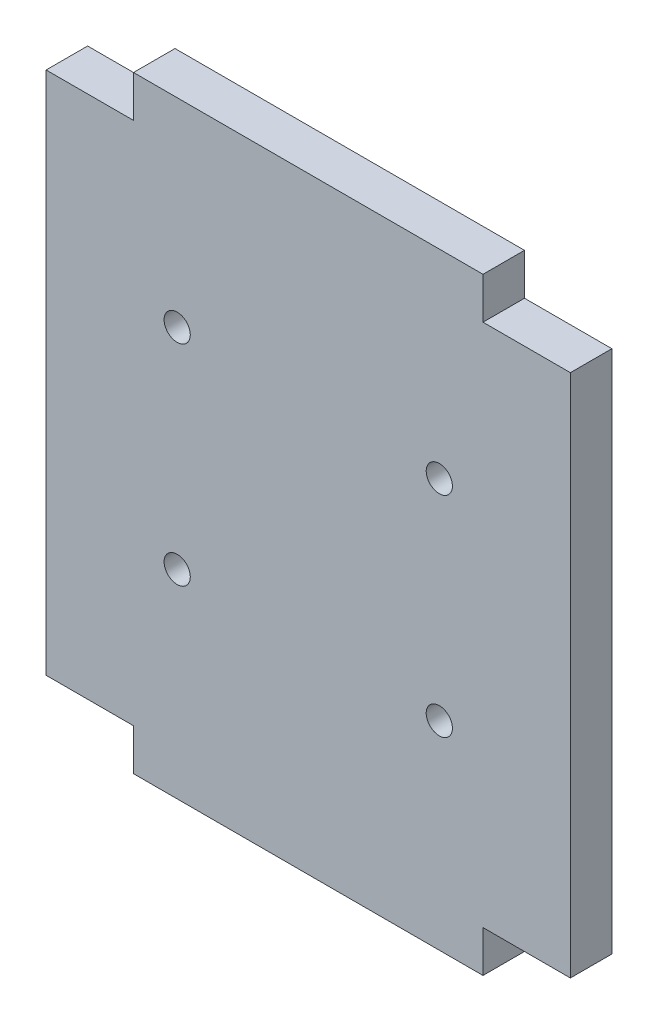
ISO-10303-21;
HEADER;
FILE_DESCRIPTION(('STEP AP214'),'2;1');
FILE_NAME('part.step','',(''),(''),'','','');
FILE_SCHEMA(('AUTOMOTIVE_DESIGN { 1 0 10303 214 1 1 1 1 }'));
ENDSEC;
DATA;
#1=APPLICATION_CONTEXT('core data for automotive mechanical design processes');
#2=APPLICATION_PROTOCOL_DEFINITION('international standard','automotive_design',2000,#1);
#3=PRODUCT_CONTEXT('',#1,'mechanical');
#4=PRODUCT('Part','Part','',(#3));
#5=PRODUCT_RELATED_PRODUCT_CATEGORY('part','',(#4));
#6=PRODUCT_DEFINITION_FORMATION('','',#4);
#7=PRODUCT_DEFINITION_CONTEXT('part definition',#1,'design');
#8=PRODUCT_DEFINITION('design','',#6,#7);
#9=PRODUCT_DEFINITION_SHAPE('','',#8);
#10=(LENGTH_UNIT() NAMED_UNIT(*) SI_UNIT(.MILLI.,.METRE.));
#11=(NAMED_UNIT(*) PLANE_ANGLE_UNIT() SI_UNIT($,.RADIAN.));
#12=(NAMED_UNIT(*) SI_UNIT($,.STERADIAN.) SOLID_ANGLE_UNIT());
#13=UNCERTAINTY_MEASURE_WITH_UNIT(LENGTH_MEASURE(1.E-05),#10,'distance_accuracy_value','');
#14=(GEOMETRIC_REPRESENTATION_CONTEXT(3) GLOBAL_UNCERTAINTY_ASSIGNED_CONTEXT((#13)) GLOBAL_UNIT_ASSIGNED_CONTEXT((#10,
#11,#12)) REPRESENTATION_CONTEXT('',''));
#15=CARTESIAN_POINT('',(0.,0.,0.));
#16=DIRECTION('',(0.,0.,1.));
#17=DIRECTION('',(1.,0.,0.));
#18=AXIS2_PLACEMENT_3D('',#15,#16,#17);
#19=CARTESIAN_POINT('',(30.,-34.75,4.75));
#20=DIRECTION('',(-1.,0.,0.));
#21=DIRECTION('',(0.,0.,1.));
#22=AXIS2_PLACEMENT_3D('',#19,#20,#21);
#23=PLANE('',#22);
#24=DIRECTION('',(0.,1.,0.));
#25=VECTOR('',#24,1.);
#26=CARTESIAN_POINT('',(30.,-34.75,0.));
#27=LINE('',#26,#25);
#28=CARTESIAN_POINT('',(30.,-30.,0.));
#29=VERTEX_POINT('',#28);
#30=CARTESIAN_POINT('',(30.,30.,0.));
#31=VERTEX_POINT('',#30);
#32=EDGE_CURVE('E157',#29,#31,#27,.T.);
#33=ORIENTED_EDGE('',*,*,#32,.T.);
#34=DIRECTION('',(0.,0.,1.));
#35=VECTOR('',#34,1.);
#36=CARTESIAN_POINT('',(30.,30.,0.));
#37=LINE('',#36,#35);
#38=CARTESIAN_POINT('',(30.,30.,4.75));
#39=VERTEX_POINT('',#38);
#40=EDGE_CURVE('E208',#31,#39,#37,.T.);
#41=ORIENTED_EDGE('',*,*,#40,.T.);
#42=DIRECTION('',(0.,1.,0.));
#43=VECTOR('',#42,1.);
#44=CARTESIAN_POINT('',(30.,-34.75,4.75));
#45=LINE('',#44,#43);
#46=CARTESIAN_POINT('',(30.,-30.,4.75));
#47=VERTEX_POINT('',#46);
#48=EDGE_CURVE('E145',#47,#39,#45,.T.);
#49=ORIENTED_EDGE('',*,*,#48,.F.);
#50=DIRECTION('',(0.,0.,1.));
#51=VECTOR('',#50,1.);
#52=CARTESIAN_POINT('',(30.,-30.,0.));
#53=LINE('',#52,#51);
#54=EDGE_CURVE('E217',#29,#47,#53,.T.);
#55=ORIENTED_EDGE('',*,*,#54,.F.);
#56=EDGE_LOOP('',(#33,#41,#49,#55));
#57=FACE_BOUND('',#56,.T.);
#58=ADVANCED_FACE('F32',(#57),#23,.F.);
#59=CARTESIAN_POINT('',(-30.,34.75,4.75));
#60=DIRECTION('',(0.,-1.,0.));
#61=DIRECTION('',(0.,0.,-1.));
#62=AXIS2_PLACEMENT_3D('',#59,#60,#61);
#63=PLANE('',#62);
#64=DIRECTION('',(-1.,0.,0.));
#65=VECTOR('',#64,1.);
#66=CARTESIAN_POINT('',(-30.,34.75,4.75));
#67=LINE('',#66,#65);
#68=CARTESIAN_POINT('',(20.,34.75,4.75));
#69=VERTEX_POINT('',#68);
#70=CARTESIAN_POINT('',(-20.,34.75,4.75));
#71=VERTEX_POINT('',#70);
#72=EDGE_CURVE('E148',#69,#71,#67,.T.);
#73=ORIENTED_EDGE('',*,*,#72,.F.);
#74=DIRECTION('',(0.,0.,1.));
#75=VECTOR('',#74,1.);
#76=CARTESIAN_POINT('',(20.,34.75,0.));
#77=LINE('',#76,#75);
#78=CARTESIAN_POINT('',(20.,34.75,0.));
#79=VERTEX_POINT('',#78);
#80=EDGE_CURVE('E204',#79,#69,#77,.T.);
#81=ORIENTED_EDGE('',*,*,#80,.F.);
#82=DIRECTION('',(-1.,0.,0.));
#83=VECTOR('',#82,1.);
#84=CARTESIAN_POINT('',(-30.,34.75,0.));
#85=LINE('',#84,#83);
#86=CARTESIAN_POINT('',(-20.,34.75,0.));
#87=VERTEX_POINT('',#86);
#88=EDGE_CURVE('E151',#79,#87,#85,.T.);
#89=ORIENTED_EDGE('',*,*,#88,.T.);
#90=DIRECTION('',(0.,0.,1.));
#91=VECTOR('',#90,1.);
#92=CARTESIAN_POINT('',(-20.,34.75,0.));
#93=LINE('',#92,#91);
#94=EDGE_CURVE('E189',#87,#71,#93,.T.);
#95=ORIENTED_EDGE('',*,*,#94,.T.);
#96=EDGE_LOOP('',(#73,#81,#89,#95));
#97=FACE_BOUND('',#96,.T.);
#98=ADVANCED_FACE('F279',(#97),#63,.F.);
#99=CARTESIAN_POINT('',(-30.,-34.75,4.75));
#100=DIRECTION('',(1.,0.,0.));
#101=DIRECTION('',(0.,0.,-1.));
#102=AXIS2_PLACEMENT_3D('',#99,#100,#101);
#103=PLANE('',#102);
#104=DIRECTION('',(0.,-1.,0.));
#105=VECTOR('',#104,1.);
#106=CARTESIAN_POINT('',(-30.,-34.75,0.));
#107=LINE('',#106,#105);
#108=CARTESIAN_POINT('',(-30.,30.,0.));
#109=VERTEX_POINT('',#108);
#110=CARTESIAN_POINT('',(-30.,-30.,0.));
#111=VERTEX_POINT('',#110);
#112=EDGE_CURVE('E146',#109,#111,#107,.T.);
#113=ORIENTED_EDGE('',*,*,#112,.T.);
#114=DIRECTION('',(0.,0.,1.));
#115=VECTOR('',#114,1.);
#116=CARTESIAN_POINT('',(-30.,-30.,0.));
#117=LINE('',#116,#115);
#118=CARTESIAN_POINT('',(-30.,-30.,4.75));
#119=VERTEX_POINT('',#118);
#120=EDGE_CURVE('E203',#111,#119,#117,.T.);
#121=ORIENTED_EDGE('',*,*,#120,.T.);
#122=DIRECTION('',(0.,-1.,0.));
#123=VECTOR('',#122,1.);
#124=CARTESIAN_POINT('',(-30.,-34.75,4.75));
#125=LINE('',#124,#123);
#126=CARTESIAN_POINT('',(-30.,30.,4.75));
#127=VERTEX_POINT('',#126);
#128=EDGE_CURVE('E40',#127,#119,#125,.T.);
#129=ORIENTED_EDGE('',*,*,#128,.F.);
#130=DIRECTION('',(0.,0.,1.));
#131=VECTOR('',#130,1.);
#132=CARTESIAN_POINT('',(-30.,30.,0.));
#133=LINE('',#132,#131);
#134=EDGE_CURVE('E190',#109,#127,#133,.T.);
#135=ORIENTED_EDGE('',*,*,#134,.F.);
#136=EDGE_LOOP('',(#113,#121,#129,#135));
#137=FACE_BOUND('',#136,.T.);
#138=ADVANCED_FACE('F288',(#137),#103,.F.);
#139=CARTESIAN_POINT('',(-30.,-34.75,4.75));
#140=DIRECTION('',(0.,1.,0.));
#141=DIRECTION('',(0.,0.,1.));
#142=AXIS2_PLACEMENT_3D('',#139,#140,#141);
#143=PLANE('',#142);
#144=DIRECTION('',(1.,0.,0.));
#145=VECTOR('',#144,1.);
#146=CARTESIAN_POINT('',(-30.,-34.75,0.));
#147=LINE('',#146,#145);
#148=CARTESIAN_POINT('',(-20.,-34.75,0.));
#149=VERTEX_POINT('',#148);
#150=CARTESIAN_POINT('',(20.,-34.75,0.));
#151=VERTEX_POINT('',#150);
#152=EDGE_CURVE('E35',#149,#151,#147,.T.);
#153=ORIENTED_EDGE('',*,*,#152,.T.);
#154=DIRECTION('',(0.,0.,1.));
#155=VECTOR('',#154,1.);
#156=CARTESIAN_POINT('',(20.,-34.75,0.));
#157=LINE('',#156,#155);
#158=CARTESIAN_POINT('',(20.,-34.75,4.75));
#159=VERTEX_POINT('',#158);
#160=EDGE_CURVE('E135',#151,#159,#157,.T.);
#161=ORIENTED_EDGE('',*,*,#160,.T.);
#162=DIRECTION('',(1.,0.,0.));
#163=VECTOR('',#162,1.);
#164=CARTESIAN_POINT('',(-30.,-34.75,4.75));
#165=LINE('',#164,#163);
#166=CARTESIAN_POINT('',(-20.,-34.75,4.75));
#167=VERTEX_POINT('',#166);
#168=EDGE_CURVE('E11',#167,#159,#165,.T.);
#169=ORIENTED_EDGE('',*,*,#168,.F.);
#170=DIRECTION('',(0.,0.,1.));
#171=VECTOR('',#170,1.);
#172=CARTESIAN_POINT('',(-20.,-34.75,0.));
#173=LINE('',#172,#171);
#174=EDGE_CURVE('E127',#149,#167,#173,.T.);
#175=ORIENTED_EDGE('',*,*,#174,.F.);
#176=EDGE_LOOP('',(#153,#161,#169,#175));
#177=FACE_BOUND('',#176,.T.);
#178=ADVANCED_FACE('F140',(#177),#143,.F.);
#179=CARTESIAN_POINT('',(0.,0.,4.75));
#180=DIRECTION('',(0.,0.,-1.));
#181=DIRECTION('',(-1.,0.,0.));
#182=AXIS2_PLACEMENT_3D('',#179,#180,#181);
#183=PLANE('',#182);
#184=CARTESIAN_POINT('',(15.,12.,4.75));
#185=DIRECTION('',(0.,0.,1.));
#186=DIRECTION('',(1.,0.,0.));
#187=AXIS2_PLACEMENT_3D('',#184,#185,#186);
#188=CIRCLE('',#187,1.5);
#189=CARTESIAN_POINT('',(16.5,12.,4.75));
#190=VERTEX_POINT('',#189);
#191=EDGE_CURVE('E233',#190,#190,#188,.T.);
#192=ORIENTED_EDGE('',*,*,#191,.F.);
#193=EDGE_LOOP('',(#192));
#194=FACE_BOUND('',#193,.T.);
#195=CARTESIAN_POINT('',(15.,-12.,4.75));
#196=DIRECTION('',(0.,0.,1.));
#197=DIRECTION('',(1.,0.,0.));
#198=AXIS2_PLACEMENT_3D('',#195,#196,#197);
#199=CIRCLE('',#198,1.5);
#200=CARTESIAN_POINT('',(16.5,-12.,4.75));
#201=VERTEX_POINT('',#200);
#202=EDGE_CURVE('E239',#201,#201,#199,.T.);
#203=ORIENTED_EDGE('',*,*,#202,.F.);
#204=EDGE_LOOP('',(#203));
#205=FACE_BOUND('',#204,.T.);
#206=CARTESIAN_POINT('',(-15.,-12.,4.75));
#207=DIRECTION('',(0.,0.,1.));
#208=DIRECTION('',(1.,0.,0.));
#209=AXIS2_PLACEMENT_3D('',#206,#207,#208);
#210=CIRCLE('',#209,1.5);
#211=CARTESIAN_POINT('',(-13.5,-12.,4.75));
#212=VERTEX_POINT('',#211);
#213=EDGE_CURVE('E245',#212,#212,#210,.T.);
#214=ORIENTED_EDGE('',*,*,#213,.F.);
#215=EDGE_LOOP('',(#214));
#216=FACE_BOUND('',#215,.T.);
#217=CARTESIAN_POINT('',(-15.,12.,4.75));
#218=DIRECTION('',(0.,0.,1.));
#219=DIRECTION('',(1.,0.,0.));
#220=AXIS2_PLACEMENT_3D('',#217,#218,#219);
#221=CIRCLE('',#220,1.5);
#222=CARTESIAN_POINT('',(-13.5,12.,4.75));
#223=VERTEX_POINT('',#222);
#224=EDGE_CURVE('E227',#223,#223,#221,.T.);
#225=ORIENTED_EDGE('',*,*,#224,.F.);
#226=EDGE_LOOP('',(#225));
#227=FACE_BOUND('',#226,.T.);
#228=ORIENTED_EDGE('',*,*,#48,.T.);
#229=DIRECTION('',(-1.,0.,0.));
#230=VECTOR('',#229,1.);
#231=CARTESIAN_POINT('',(0.,30.,4.75));
#232=LINE('',#231,#230);
#233=CARTESIAN_POINT('',(20.,30.,4.75));
#234=VERTEX_POINT('',#233);
#235=EDGE_CURVE('E161',#39,#234,#232,.T.);
#236=ORIENTED_EDGE('',*,*,#235,.T.);
#237=DIRECTION('',(0.,1.,0.));
#238=VECTOR('',#237,1.);
#239=CARTESIAN_POINT('',(20.,0.,4.75));
#240=LINE('',#239,#238);
#241=EDGE_CURVE('E169',#234,#69,#240,.T.);
#242=ORIENTED_EDGE('',*,*,#241,.T.);
#243=ORIENTED_EDGE('',*,*,#72,.T.);
#244=DIRECTION('',(0.,-1.,0.));
#245=VECTOR('',#244,1.);
#246=CARTESIAN_POINT('',(-20.,0.,4.75));
#247=LINE('',#246,#245);
#248=CARTESIAN_POINT('',(-20.,30.,4.75));
#249=VERTEX_POINT('',#248);
#250=EDGE_CURVE('E183',#71,#249,#247,.T.);
#251=ORIENTED_EDGE('',*,*,#250,.T.);
#252=DIRECTION('',(-1.,0.,0.));
#253=VECTOR('',#252,1.);
#254=CARTESIAN_POINT('',(0.,30.,4.75));
#255=LINE('',#254,#253);
#256=EDGE_CURVE('E186',#249,#127,#255,.T.);
#257=ORIENTED_EDGE('',*,*,#256,.T.);
#258=ORIENTED_EDGE('',*,*,#128,.T.);
#259=DIRECTION('',(1.,0.,0.));
#260=VECTOR('',#259,1.);
#261=CARTESIAN_POINT('',(0.,-30.,4.75));
#262=LINE('',#261,#260);
#263=CARTESIAN_POINT('',(-20.,-30.,4.75));
#264=VERTEX_POINT('',#263);
#265=EDGE_CURVE('E178',#119,#264,#262,.T.);
#266=ORIENTED_EDGE('',*,*,#265,.T.);
#267=DIRECTION('',(0.,-1.,0.));
#268=VECTOR('',#267,1.);
#269=CARTESIAN_POINT('',(-20.,0.,4.75));
#270=LINE('',#269,#268);
#271=EDGE_CURVE('E181',#264,#167,#270,.T.);
#272=ORIENTED_EDGE('',*,*,#271,.T.);
#273=ORIENTED_EDGE('',*,*,#168,.T.);
#274=DIRECTION('',(0.,1.,0.));
#275=VECTOR('',#274,1.);
#276=CARTESIAN_POINT('',(20.,0.,4.75));
#277=LINE('',#276,#275);
#278=CARTESIAN_POINT('',(20.,-30.,4.75));
#279=VERTEX_POINT('',#278);
#280=EDGE_CURVE('E172',#159,#279,#277,.T.);
#281=ORIENTED_EDGE('',*,*,#280,.T.);
#282=DIRECTION('',(1.,0.,0.));
#283=VECTOR('',#282,1.);
#284=CARTESIAN_POINT('',(0.,-30.,4.75));
#285=LINE('',#284,#283);
#286=EDGE_CURVE('E175',#279,#47,#285,.T.);
#287=ORIENTED_EDGE('',*,*,#286,.T.);
#288=EDGE_LOOP('',(#228,#236,#242,#243,#251,#257,#258,#266,#272,#273,#281,#287));
#289=FACE_BOUND('',#288,.T.);
#290=ADVANCED_FACE('F261',(#194,#205,#216,#227,#289),#183,.F.);
#291=CARTESIAN_POINT('',(0.,0.,0.));
#292=DIRECTION('',(0.,0.,-1.));
#293=DIRECTION('',(-1.,0.,0.));
#294=AXIS2_PLACEMENT_3D('',#291,#292,#293);
#295=PLANE('',#294);
#296=CARTESIAN_POINT('',(15.,12.,0.));
#297=DIRECTION('',(0.,0.,1.));
#298=DIRECTION('',(1.,0.,0.));
#299=AXIS2_PLACEMENT_3D('',#296,#297,#298);
#300=CIRCLE('',#299,1.5);
#301=CARTESIAN_POINT('',(16.5,12.,0.));
#302=VERTEX_POINT('',#301);
#303=EDGE_CURVE('E236',#302,#302,#300,.T.);
#304=ORIENTED_EDGE('',*,*,#303,.T.);
#305=EDGE_LOOP('',(#304));
#306=FACE_BOUND('',#305,.T.);
#307=CARTESIAN_POINT('',(15.,-12.,0.));
#308=DIRECTION('',(0.,0.,1.));
#309=DIRECTION('',(1.,0.,0.));
#310=AXIS2_PLACEMENT_3D('',#307,#308,#309);
#311=CIRCLE('',#310,1.5);
#312=CARTESIAN_POINT('',(16.5,-12.,0.));
#313=VERTEX_POINT('',#312);
#314=EDGE_CURVE('E242',#313,#313,#311,.T.);
#315=ORIENTED_EDGE('',*,*,#314,.T.);
#316=EDGE_LOOP('',(#315));
#317=FACE_BOUND('',#316,.T.);
#318=CARTESIAN_POINT('',(-15.,-12.,0.));
#319=DIRECTION('',(0.,0.,1.));
#320=DIRECTION('',(1.,0.,0.));
#321=AXIS2_PLACEMENT_3D('',#318,#319,#320);
#322=CIRCLE('',#321,1.5);
#323=CARTESIAN_POINT('',(-13.5,-12.,0.));
#324=VERTEX_POINT('',#323);
#325=EDGE_CURVE('E230',#324,#324,#322,.T.);
#326=ORIENTED_EDGE('',*,*,#325,.T.);
#327=EDGE_LOOP('',(#326));
#328=FACE_BOUND('',#327,.T.);
#329=CARTESIAN_POINT('',(-15.,12.,0.));
#330=DIRECTION('',(0.,0.,1.));
#331=DIRECTION('',(1.,0.,0.));
#332=AXIS2_PLACEMENT_3D('',#329,#330,#331);
#333=CIRCLE('',#332,1.5);
#334=CARTESIAN_POINT('',(-13.5,12.,0.));
#335=VERTEX_POINT('',#334);
#336=EDGE_CURVE('E216',#335,#335,#333,.T.);
#337=ORIENTED_EDGE('',*,*,#336,.T.);
#338=EDGE_LOOP('',(#337));
#339=FACE_BOUND('',#338,.T.);
#340=DIRECTION('',(1.,0.,0.));
#341=VECTOR('',#340,1.);
#342=CARTESIAN_POINT('',(30.,30.,0.));
#343=LINE('',#342,#341);
#344=CARTESIAN_POINT('',(20.,30.,0.));
#345=VERTEX_POINT('',#344);
#346=EDGE_CURVE('E48',#345,#31,#343,.T.);
#347=ORIENTED_EDGE('',*,*,#346,.T.);
#348=ORIENTED_EDGE('',*,*,#32,.F.);
#349=DIRECTION('',(-1.,0.,0.));
#350=VECTOR('',#349,1.);
#351=CARTESIAN_POINT('',(30.,-30.,0.));
#352=LINE('',#351,#350);
#353=CARTESIAN_POINT('',(20.,-30.,0.));
#354=VERTEX_POINT('',#353);
#355=EDGE_CURVE('E211',#29,#354,#352,.T.);
#356=ORIENTED_EDGE('',*,*,#355,.T.);
#357=DIRECTION('',(0.,-1.,0.));
#358=VECTOR('',#357,1.);
#359=CARTESIAN_POINT('',(20.,-34.75,0.));
#360=LINE('',#359,#358);
#361=EDGE_CURVE('E56',#354,#151,#360,.T.);
#362=ORIENTED_EDGE('',*,*,#361,.T.);
#363=ORIENTED_EDGE('',*,*,#152,.F.);
#364=DIRECTION('',(0.,1.,0.));
#365=VECTOR('',#364,1.);
#366=CARTESIAN_POINT('',(-20.,-34.75,0.));
#367=LINE('',#366,#365);
#368=CARTESIAN_POINT('',(-20.,-30.,0.));
#369=VERTEX_POINT('',#368);
#370=EDGE_CURVE('E124',#149,#369,#367,.T.);
#371=ORIENTED_EDGE('',*,*,#370,.T.);
#372=DIRECTION('',(-1.,0.,0.));
#373=VECTOR('',#372,1.);
#374=CARTESIAN_POINT('',(-30.,-30.,0.));
#375=LINE('',#374,#373);
#376=EDGE_CURVE('E134',#369,#111,#375,.T.);
#377=ORIENTED_EDGE('',*,*,#376,.T.);
#378=ORIENTED_EDGE('',*,*,#112,.F.);
#379=DIRECTION('',(1.,0.,0.));
#380=VECTOR('',#379,1.);
#381=CARTESIAN_POINT('',(-30.,30.,0.));
#382=LINE('',#381,#380);
#383=CARTESIAN_POINT('',(-20.,30.,0.));
#384=VERTEX_POINT('',#383);
#385=EDGE_CURVE('E200',#109,#384,#382,.T.);
#386=ORIENTED_EDGE('',*,*,#385,.T.);
#387=DIRECTION('',(0.,1.,0.));
#388=VECTOR('',#387,1.);
#389=CARTESIAN_POINT('',(-20.,34.75,0.));
#390=LINE('',#389,#388);
#391=EDGE_CURVE('E193',#384,#87,#390,.T.);
#392=ORIENTED_EDGE('',*,*,#391,.T.);
#393=ORIENTED_EDGE('',*,*,#88,.F.);
#394=DIRECTION('',(0.,-1.,0.));
#395=VECTOR('',#394,1.);
#396=CARTESIAN_POINT('',(20.,34.75,0.));
#397=LINE('',#396,#395);
#398=EDGE_CURVE('E213',#79,#345,#397,.T.);
#399=ORIENTED_EDGE('',*,*,#398,.T.);
#400=EDGE_LOOP('',(#347,#348,#356,#362,#363,#371,#377,#378,#386,#392,#393,#399));
#401=FACE_BOUND('',#400,.T.);
#402=ADVANCED_FACE('F143',(#306,#317,#328,#339,#401),#295,.T.);
#403=CARTESIAN_POINT('',(-20.,34.75,0.));
#404=DIRECTION('',(1.,0.,0.));
#405=DIRECTION('',(0.,0.,-1.));
#406=AXIS2_PLACEMENT_3D('',#403,#404,#405);
#407=PLANE('',#406);
#408=ORIENTED_EDGE('',*,*,#94,.F.);
#409=ORIENTED_EDGE('',*,*,#391,.F.);
#410=DIRECTION('',(0.,0.,1.));
#411=VECTOR('',#410,1.);
#412=CARTESIAN_POINT('',(-20.,30.,0.));
#413=LINE('',#412,#411);
#414=EDGE_CURVE('E192',#384,#249,#413,.T.);
#415=ORIENTED_EDGE('',*,*,#414,.T.);
#416=ORIENTED_EDGE('',*,*,#250,.F.);
#417=EDGE_LOOP('',(#408,#409,#415,#416));
#418=FACE_BOUND('',#417,.T.);
#419=ADVANCED_FACE('F282',(#418),#407,.F.);
#420=CARTESIAN_POINT('',(-30.,30.,0.));
#421=DIRECTION('',(0.,-1.,0.));
#422=DIRECTION('',(1.,0.,0.));
#423=AXIS2_PLACEMENT_3D('',#420,#421,#422);
#424=PLANE('',#423);
#425=ORIENTED_EDGE('',*,*,#414,.F.);
#426=ORIENTED_EDGE('',*,*,#385,.F.);
#427=ORIENTED_EDGE('',*,*,#134,.T.);
#428=ORIENTED_EDGE('',*,*,#256,.F.);
#429=EDGE_LOOP('',(#425,#426,#427,#428));
#430=FACE_BOUND('',#429,.T.);
#431=ADVANCED_FACE('F285',(#430),#424,.F.);
#432=CARTESIAN_POINT('',(-30.,-30.,0.));
#433=DIRECTION('',(0.,1.,0.));
#434=DIRECTION('',(-1.,0.,0.));
#435=AXIS2_PLACEMENT_3D('',#432,#433,#434);
#436=PLANE('',#435);
#437=ORIENTED_EDGE('',*,*,#120,.F.);
#438=ORIENTED_EDGE('',*,*,#376,.F.);
#439=DIRECTION('',(0.,0.,1.));
#440=VECTOR('',#439,1.);
#441=CARTESIAN_POINT('',(-20.,-30.,0.));
#442=LINE('',#441,#440);
#443=EDGE_CURVE('E130',#369,#264,#442,.T.);
#444=ORIENTED_EDGE('',*,*,#443,.T.);
#445=ORIENTED_EDGE('',*,*,#265,.F.);
#446=EDGE_LOOP('',(#437,#438,#444,#445));
#447=FACE_BOUND('',#446,.T.);
#448=ADVANCED_FACE('F287',(#447),#436,.F.);
#449=CARTESIAN_POINT('',(-20.,-34.75,0.));
#450=DIRECTION('',(1.,0.,0.));
#451=DIRECTION('',(0.,0.,-1.));
#452=AXIS2_PLACEMENT_3D('',#449,#450,#451);
#453=PLANE('',#452);
#454=ORIENTED_EDGE('',*,*,#443,.F.);
#455=ORIENTED_EDGE('',*,*,#370,.F.);
#456=ORIENTED_EDGE('',*,*,#174,.T.);
#457=ORIENTED_EDGE('',*,*,#271,.F.);
#458=EDGE_LOOP('',(#454,#455,#456,#457));
#459=FACE_BOUND('',#458,.T.);
#460=ADVANCED_FACE('F126',(#459),#453,.F.);
#461=CARTESIAN_POINT('',(20.,-34.75,0.));
#462=DIRECTION('',(-1.,0.,0.));
#463=DIRECTION('',(0.,0.,1.));
#464=AXIS2_PLACEMENT_3D('',#461,#462,#463);
#465=PLANE('',#464);
#466=ORIENTED_EDGE('',*,*,#160,.F.);
#467=ORIENTED_EDGE('',*,*,#361,.F.);
#468=DIRECTION('',(0.,0.,1.));
#469=VECTOR('',#468,1.);
#470=CARTESIAN_POINT('',(20.,-30.,0.));
#471=LINE('',#470,#469);
#472=EDGE_CURVE('E219',#354,#279,#471,.T.);
#473=ORIENTED_EDGE('',*,*,#472,.T.);
#474=ORIENTED_EDGE('',*,*,#280,.F.);
#475=EDGE_LOOP('',(#466,#467,#473,#474));
#476=FACE_BOUND('',#475,.T.);
#477=ADVANCED_FACE('F289',(#476),#465,.F.);
#478=CARTESIAN_POINT('',(30.,-30.,0.));
#479=DIRECTION('',(0.,1.,0.));
#480=DIRECTION('',(-1.,0.,0.));
#481=AXIS2_PLACEMENT_3D('',#478,#479,#480);
#482=PLANE('',#481);
#483=ORIENTED_EDGE('',*,*,#472,.F.);
#484=ORIENTED_EDGE('',*,*,#355,.F.);
#485=ORIENTED_EDGE('',*,*,#54,.T.);
#486=ORIENTED_EDGE('',*,*,#286,.F.);
#487=EDGE_LOOP('',(#483,#484,#485,#486));
#488=FACE_BOUND('',#487,.T.);
#489=ADVANCED_FACE('F291',(#488),#482,.F.);
#490=CARTESIAN_POINT('',(30.,30.,0.));
#491=DIRECTION('',(0.,-1.,0.));
#492=DIRECTION('',(1.,0.,0.));
#493=AXIS2_PLACEMENT_3D('',#490,#491,#492);
#494=PLANE('',#493);
#495=ORIENTED_EDGE('',*,*,#40,.F.);
#496=ORIENTED_EDGE('',*,*,#346,.F.);
#497=DIRECTION('',(0.,0.,1.));
#498=VECTOR('',#497,1.);
#499=CARTESIAN_POINT('',(20.,30.,0.));
#500=LINE('',#499,#498);
#501=EDGE_CURVE('E206',#345,#234,#500,.T.);
#502=ORIENTED_EDGE('',*,*,#501,.T.);
#503=ORIENTED_EDGE('',*,*,#235,.F.);
#504=EDGE_LOOP('',(#495,#496,#502,#503));
#505=FACE_BOUND('',#504,.T.);
#506=ADVANCED_FACE('F272',(#505),#494,.F.);
#507=CARTESIAN_POINT('',(20.,34.75,0.));
#508=DIRECTION('',(-1.,0.,0.));
#509=DIRECTION('',(0.,0.,1.));
#510=AXIS2_PLACEMENT_3D('',#507,#508,#509);
#511=PLANE('',#510);
#512=ORIENTED_EDGE('',*,*,#501,.F.);
#513=ORIENTED_EDGE('',*,*,#398,.F.);
#514=ORIENTED_EDGE('',*,*,#80,.T.);
#515=ORIENTED_EDGE('',*,*,#241,.F.);
#516=EDGE_LOOP('',(#512,#513,#514,#515));
#517=FACE_BOUND('',#516,.T.);
#518=ADVANCED_FACE('F276',(#517),#511,.F.);
#519=CARTESIAN_POINT('',(-15.,12.,0.));
#520=DIRECTION('',(0.,0.,1.));
#521=DIRECTION('',(1.,0.,0.));
#522=AXIS2_PLACEMENT_3D('',#519,#520,#521);
#523=CYLINDRICAL_SURFACE('',#522,1.5);
#524=ORIENTED_EDGE('',*,*,#336,.F.);
#525=EDGE_LOOP('',(#524));
#526=FACE_BOUND('',#525,.T.);
#527=ORIENTED_EDGE('',*,*,#224,.T.);
#528=EDGE_LOOP('',(#527));
#529=FACE_BOUND('',#528,.T.);
#530=ADVANCED_FACE('F257',(#526,#529),#523,.F.);
#531=CARTESIAN_POINT('',(-15.,-12.,0.));
#532=DIRECTION('',(0.,0.,1.));
#533=DIRECTION('',(1.,0.,0.));
#534=AXIS2_PLACEMENT_3D('',#531,#532,#533);
#535=CYLINDRICAL_SURFACE('',#534,1.5);
#536=ORIENTED_EDGE('',*,*,#325,.F.);
#537=EDGE_LOOP('',(#536));
#538=FACE_BOUND('',#537,.T.);
#539=ORIENTED_EDGE('',*,*,#213,.T.);
#540=EDGE_LOOP('',(#539));
#541=FACE_BOUND('',#540,.T.);
#542=ADVANCED_FACE('F253',(#538,#541),#535,.F.);
#543=CARTESIAN_POINT('',(15.,-12.,0.));
#544=DIRECTION('',(0.,0.,1.));
#545=DIRECTION('',(1.,0.,0.));
#546=AXIS2_PLACEMENT_3D('',#543,#544,#545);
#547=CYLINDRICAL_SURFACE('',#546,1.5);
#548=ORIENTED_EDGE('',*,*,#314,.F.);
#549=EDGE_LOOP('',(#548));
#550=FACE_BOUND('',#549,.T.);
#551=ORIENTED_EDGE('',*,*,#202,.T.);
#552=EDGE_LOOP('',(#551));
#553=FACE_BOUND('',#552,.T.);
#554=ADVANCED_FACE('F256',(#550,#553),#547,.F.);
#555=CARTESIAN_POINT('',(15.,12.,0.));
#556=DIRECTION('',(0.,0.,1.));
#557=DIRECTION('',(1.,0.,0.));
#558=AXIS2_PLACEMENT_3D('',#555,#556,#557);
#559=CYLINDRICAL_SURFACE('',#558,1.5);
#560=ORIENTED_EDGE('',*,*,#303,.F.);
#561=EDGE_LOOP('',(#560));
#562=FACE_BOUND('',#561,.T.);
#563=ORIENTED_EDGE('',*,*,#191,.T.);
#564=EDGE_LOOP('',(#563));
#565=FACE_BOUND('',#564,.T.);
#566=ADVANCED_FACE('F330',(#562,#565),#559,.F.);
#567=CLOSED_SHELL('',(#58,#98,#138,#178,#290,#402,#419,#431,#448,#460,#477,#489,#506,#518,#530,
#542,#554,#566));
#568=MANIFOLD_SOLID_BREP('B2',#567);
#569=ADVANCED_BREP_SHAPE_REPRESENTATION('',(#18,#568),#14);
#570=SHAPE_DEFINITION_REPRESENTATION(#9,#569);
ENDSEC;
END-ISO-10303-21;
